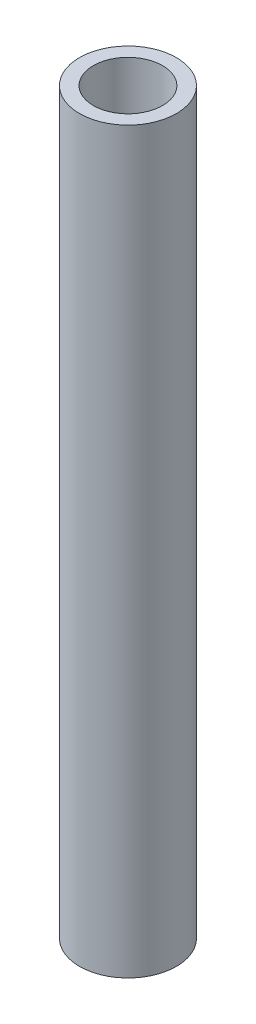
ISO-10303-21;
HEADER;
FILE_DESCRIPTION(('STEP AP214'),'2;1');
FILE_NAME('part.step','',(''),(''),'','','');
FILE_SCHEMA(('AUTOMOTIVE_DESIGN { 1 0 10303 214 1 1 1 1 }'));
ENDSEC;
DATA;
#1=APPLICATION_CONTEXT('core data for automotive mechanical design processes');
#2=APPLICATION_PROTOCOL_DEFINITION('international standard','automotive_design',2000,#1);
#3=PRODUCT_CONTEXT('',#1,'mechanical');
#4=PRODUCT('Part','Part','',(#3));
#5=PRODUCT_RELATED_PRODUCT_CATEGORY('part','',(#4));
#6=PRODUCT_DEFINITION_FORMATION('','',#4);
#7=PRODUCT_DEFINITION_CONTEXT('part definition',#1,'design');
#8=PRODUCT_DEFINITION('design','',#6,#7);
#9=PRODUCT_DEFINITION_SHAPE('','',#8);
#10=(LENGTH_UNIT() NAMED_UNIT(*) SI_UNIT(.MILLI.,.METRE.));
#11=(NAMED_UNIT(*) PLANE_ANGLE_UNIT() SI_UNIT($,.RADIAN.));
#12=(NAMED_UNIT(*) SI_UNIT($,.STERADIAN.) SOLID_ANGLE_UNIT());
#13=UNCERTAINTY_MEASURE_WITH_UNIT(LENGTH_MEASURE(1.E-05),#10,'distance_accuracy_value','');
#14=(GEOMETRIC_REPRESENTATION_CONTEXT(3) GLOBAL_UNCERTAINTY_ASSIGNED_CONTEXT((#13)) GLOBAL_UNIT_ASSIGNED_CONTEXT((#10,
#11,#12)) REPRESENTATION_CONTEXT('',''));
#15=CARTESIAN_POINT('',(0.,0.,0.));
#16=DIRECTION('',(0.,0.,1.));
#17=DIRECTION('',(1.,0.,0.));
#18=AXIS2_PLACEMENT_3D('',#15,#16,#17);
#19=CARTESIAN_POINT('',(0.,203.2,0.));
#20=DIRECTION('',(0.,1.,0.));
#21=DIRECTION('',(0.,0.,1.));
#22=AXIS2_PLACEMENT_3D('',#19,#20,#21);
#23=PLANE('',#22);
#24=CARTESIAN_POINT('',(0.,203.2,0.));
#25=DIRECTION('',(0.,1.,0.));
#26=DIRECTION('',(0.,0.,1.));
#27=AXIS2_PLACEMENT_3D('',#24,#25,#26);
#28=CIRCLE('',#27,13.335);
#29=CARTESIAN_POINT('',(0.,203.2,13.335));
#30=VERTEX_POINT('',#29);
#31=EDGE_CURVE('E10',#30,#30,#28,.T.);
#32=ORIENTED_EDGE('',*,*,#31,.T.);
#33=EDGE_LOOP('',(#32));
#34=FACE_BOUND('',#33,.T.);
#35=CARTESIAN_POINT('',(0.,203.2,0.));
#36=DIRECTION('',(0.,1.,0.));
#37=DIRECTION('',(0.,0.,1.));
#38=AXIS2_PLACEMENT_3D('',#35,#36,#37);
#39=CIRCLE('',#38,9.525);
#40=CARTESIAN_POINT('',(0.,203.2,9.525));
#41=VERTEX_POINT('',#40);
#42=EDGE_CURVE('E42',#41,#41,#39,.T.);
#43=ORIENTED_EDGE('',*,*,#42,.F.);
#44=EDGE_LOOP('',(#43));
#45=FACE_BOUND('',#44,.T.);
#46=ADVANCED_FACE('F31',(#34,#45),#23,.T.);
#47=CARTESIAN_POINT('',(0.,0.,0.));
#48=DIRECTION('',(0.,1.,0.));
#49=DIRECTION('',(0.,0.,1.));
#50=AXIS2_PLACEMENT_3D('',#47,#48,#49);
#51=PLANE('',#50);
#52=CARTESIAN_POINT('',(0.,0.,0.));
#53=DIRECTION('',(0.,1.,0.));
#54=DIRECTION('',(0.,0.,1.));
#55=AXIS2_PLACEMENT_3D('',#52,#53,#54);
#56=CIRCLE('',#55,13.335);
#57=CARTESIAN_POINT('',(0.,0.,13.335));
#58=VERTEX_POINT('',#57);
#59=EDGE_CURVE('E35',#58,#58,#56,.T.);
#60=ORIENTED_EDGE('',*,*,#59,.F.);
#61=EDGE_LOOP('',(#60));
#62=FACE_BOUND('',#61,.T.);
#63=CARTESIAN_POINT('',(0.,0.,0.));
#64=DIRECTION('',(0.,1.,0.));
#65=DIRECTION('',(0.,0.,1.));
#66=AXIS2_PLACEMENT_3D('',#63,#64,#65);
#67=CIRCLE('',#66,9.525);
#68=CARTESIAN_POINT('',(0.,0.,9.525));
#69=VERTEX_POINT('',#68);
#70=EDGE_CURVE('E44',#69,#69,#67,.T.);
#71=ORIENTED_EDGE('',*,*,#70,.T.);
#72=EDGE_LOOP('',(#71));
#73=FACE_BOUND('',#72,.T.);
#74=ADVANCED_FACE('F54',(#62,#73),#51,.F.);
#75=CARTESIAN_POINT('',(0.,203.2,0.));
#76=DIRECTION('',(0.,-1.,0.));
#77=DIRECTION('',(0.,0.,-1.));
#78=AXIS2_PLACEMENT_3D('',#75,#76,#77);
#79=CYLINDRICAL_SURFACE('',#78,13.335);
#80=ORIENTED_EDGE('',*,*,#31,.F.);
#81=EDGE_LOOP('',(#80));
#82=FACE_BOUND('',#81,.T.);
#83=ORIENTED_EDGE('',*,*,#59,.T.);
#84=EDGE_LOOP('',(#83));
#85=FACE_BOUND('',#84,.T.);
#86=ADVANCED_FACE('F33',(#82,#85),#79,.T.);
#87=CARTESIAN_POINT('',(0.,203.2,0.));
#88=DIRECTION('',(0.,-1.,0.));
#89=DIRECTION('',(0.,0.,-1.));
#90=AXIS2_PLACEMENT_3D('',#87,#88,#89);
#91=CYLINDRICAL_SURFACE('',#90,9.525);
#92=ORIENTED_EDGE('',*,*,#42,.T.);
#93=EDGE_LOOP('',(#92));
#94=FACE_BOUND('',#93,.T.);
#95=ORIENTED_EDGE('',*,*,#70,.F.);
#96=EDGE_LOOP('',(#95));
#97=FACE_BOUND('',#96,.T.);
#98=ADVANCED_FACE('F50',(#94,#97),#91,.F.);
#99=CLOSED_SHELL('',(#46,#74,#86,#98));
#100=MANIFOLD_SOLID_BREP('B2',#99);
#101=ADVANCED_BREP_SHAPE_REPRESENTATION('',(#18,#100),#14);
#102=SHAPE_DEFINITION_REPRESENTATION(#9,#101);
ENDSEC;
END-ISO-10303-21;
